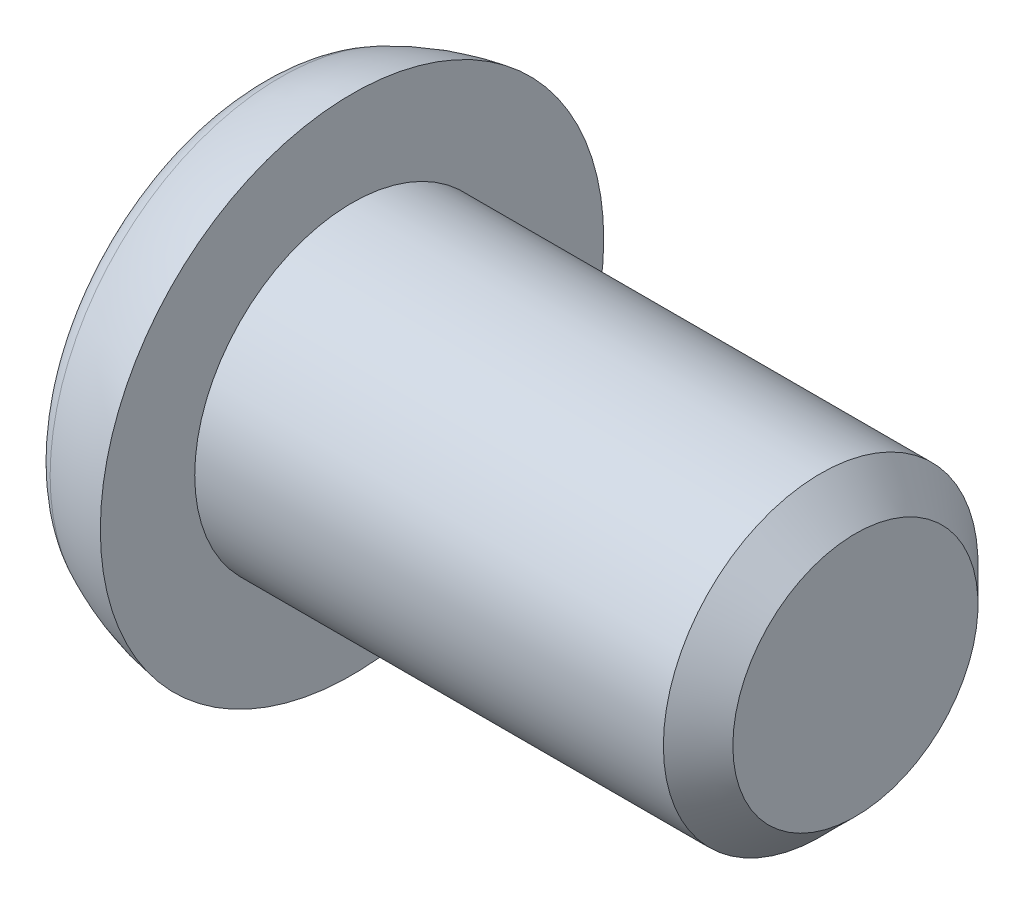
ISO-10303-21;
HEADER;
FILE_DESCRIPTION(('STEP AP214'),'2;1');
FILE_NAME('part.step','',(''),(''),'','','');
FILE_SCHEMA(('AUTOMOTIVE_DESIGN { 1 0 10303 214 1 1 1 1 }'));
ENDSEC;
DATA;
#1=APPLICATION_CONTEXT('core data for automotive mechanical design processes');
#2=APPLICATION_PROTOCOL_DEFINITION('international standard','automotive_design',2000,#1);
#3=PRODUCT_CONTEXT('',#1,'mechanical');
#4=PRODUCT('Part','Part','',(#3));
#5=PRODUCT_RELATED_PRODUCT_CATEGORY('part','',(#4));
#6=PRODUCT_DEFINITION_FORMATION('','',#4);
#7=PRODUCT_DEFINITION_CONTEXT('part definition',#1,'design');
#8=PRODUCT_DEFINITION('design','',#6,#7);
#9=PRODUCT_DEFINITION_SHAPE('','',#8);
#10=(LENGTH_UNIT() NAMED_UNIT(*) SI_UNIT(.MILLI.,.METRE.));
#11=(NAMED_UNIT(*) PLANE_ANGLE_UNIT() SI_UNIT($,.RADIAN.));
#12=(NAMED_UNIT(*) SI_UNIT($,.STERADIAN.) SOLID_ANGLE_UNIT());
#13=UNCERTAINTY_MEASURE_WITH_UNIT(LENGTH_MEASURE(1.E-05),#10,'distance_accuracy_value','');
#14=(GEOMETRIC_REPRESENTATION_CONTEXT(3) GLOBAL_UNCERTAINTY_ASSIGNED_CONTEXT((#13)) GLOBAL_UNIT_ASSIGNED_CONTEXT((#10,
#11,#12)) REPRESENTATION_CONTEXT('',''));
#15=CARTESIAN_POINT('',(0.,0.,0.));
#16=DIRECTION('',(0.,0.,1.));
#17=DIRECTION('',(1.,0.,0.));
#18=AXIS2_PLACEMENT_3D('',#15,#16,#17);
#19=CARTESIAN_POINT('',(-1.18104045222202,0.553965306488662,0.2));
#20=DIRECTION('',(0.,0.,-1.));
#21=DIRECTION('',(-1.,0.,0.));
#22=AXIS2_PLACEMENT_3D('',#19,#20,#21);
#23=CYLINDRICAL_SURFACE('',#22,1.59999999999999);
#24=CARTESIAN_POINT('',(-1.18104045222202,0.553965306488662,0.2));
#25=DIRECTION('',(0.,0.,1.));
#26=DIRECTION('',(1.,0.,0.));
#27=AXIS2_PLACEMENT_3D('',#24,#25,#26);
#28=CIRCLE('',#27,1.59999999999999);
#29=CARTESIAN_POINT('',(-0.8,-1.,0.2));
#30=VERTEX_POINT('',#29);
#31=CARTESIAN_POINT('',(0.230177573673136,-0.2,0.2));
#32=VERTEX_POINT('',#31);
#33=EDGE_CURVE('E194',#30,#32,#28,.T.);
#34=ORIENTED_EDGE('',*,*,#33,.T.);
#35=DIRECTION('',(0.,0.,-1.));
#36=VECTOR('',#35,1.);
#37=CARTESIAN_POINT('',(0.230177573673136,-0.2,0.2));
#38=LINE('',#37,#36);
#39=CARTESIAN_POINT('',(0.230177573673136,-0.2,-0.2));
#40=VERTEX_POINT('',#39);
#41=EDGE_CURVE('E137',#32,#40,#38,.T.);
#42=ORIENTED_EDGE('',*,*,#41,.T.);
#43=CARTESIAN_POINT('',(-1.18104045222202,0.553965306488662,-0.2));
#44=DIRECTION('',(0.,0.,1.));
#45=DIRECTION('',(1.,0.,0.));
#46=AXIS2_PLACEMENT_3D('',#43,#44,#45);
#47=CIRCLE('',#46,1.59999999999999);
#48=CARTESIAN_POINT('',(-0.8,-1.,-0.2));
#49=VERTEX_POINT('',#48);
#50=EDGE_CURVE('E183',#49,#40,#47,.T.);
#51=ORIENTED_EDGE('',*,*,#50,.F.);
#52=DIRECTION('',(0.,0.,-1.));
#53=VECTOR('',#52,1.);
#54=CARTESIAN_POINT('',(-0.8,-1.,0.2));
#55=LINE('',#54,#53);
#56=EDGE_CURVE('E205',#30,#49,#55,.T.);
#57=ORIENTED_EDGE('',*,*,#56,.F.);
#58=EDGE_LOOP('',(#34,#42,#51,#57));
#59=FACE_BOUND('',#58,.T.);
#60=ADVANCED_FACE('F37',(#59),#23,.F.);
#61=CARTESIAN_POINT('',(-1.18104045222202,0.553965306488662,0.2));
#62=DIRECTION('',(0.,0.,1.));
#63=DIRECTION('',(1.,0.,0.));
#64=AXIS2_PLACEMENT_3D('',#61,#62,#63);
#65=PLANE('',#64);
#66=DIRECTION('',(-1.,0.,0.));
#67=VECTOR('',#66,1.);
#68=CARTESIAN_POINT('',(-1.18104045222202,-0.2,0.2));
#69=LINE('',#68,#67);
#70=CARTESIAN_POINT('',(-0.8,-0.2,0.2));
#71=VERTEX_POINT('',#70);
#72=EDGE_CURVE('E166',#32,#71,#69,.T.);
#73=ORIENTED_EDGE('',*,*,#72,.F.);
#74=ORIENTED_EDGE('',*,*,#33,.F.);
#75=DIRECTION('',(0.,-1.,0.));
#76=VECTOR('',#75,1.);
#77=CARTESIAN_POINT('',(-0.8,1.,0.2));
#78=LINE('',#77,#76);
#79=EDGE_CURVE('E201',#71,#30,#78,.T.);
#80=ORIENTED_EDGE('',*,*,#79,.F.);
#81=EDGE_LOOP('',(#73,#74,#80));
#82=FACE_BOUND('',#81,.T.);
#83=ADVANCED_FACE('F283',(#82),#65,.F.);
#84=CARTESIAN_POINT('',(-1.18104045222202,0.553965306488662,-0.2));
#85=DIRECTION('',(0.,0.,1.));
#86=DIRECTION('',(1.,0.,0.));
#87=AXIS2_PLACEMENT_3D('',#84,#85,#86);
#88=PLANE('',#87);
#89=ORIENTED_EDGE('',*,*,#50,.T.);
#90=DIRECTION('',(-1.,0.,0.));
#91=VECTOR('',#90,1.);
#92=CARTESIAN_POINT('',(-1.18104045222202,-0.2,-0.2));
#93=LINE('',#92,#91);
#94=CARTESIAN_POINT('',(-0.8,-0.2,-0.2));
#95=VERTEX_POINT('',#94);
#96=EDGE_CURVE('E233',#40,#95,#93,.T.);
#97=ORIENTED_EDGE('',*,*,#96,.T.);
#98=DIRECTION('',(0.,-1.,0.));
#99=VECTOR('',#98,1.);
#100=CARTESIAN_POINT('',(-0.8,1.,-0.2));
#101=LINE('',#100,#99);
#102=EDGE_CURVE('E189',#95,#49,#101,.T.);
#103=ORIENTED_EDGE('',*,*,#102,.T.);
#104=EDGE_LOOP('',(#89,#97,#103));
#105=FACE_BOUND('',#104,.T.);
#106=ADVANCED_FACE('F289',(#105),#88,.T.);
#107=CARTESIAN_POINT('',(-0.8,0.,0.));
#108=DIRECTION('',(1.,0.,0.));
#109=DIRECTION('',(0.,0.,-1.));
#110=AXIS2_PLACEMENT_3D('',#107,#108,#109);
#111=PLANE('',#110);
#112=DIRECTION('',(0.,-1.,0.));
#113=VECTOR('',#112,1.);
#114=CARTESIAN_POINT('',(-0.8,0.2,-1.));
#115=LINE('',#114,#113);
#116=CARTESIAN_POINT('',(-0.8,0.2,-1.));
#117=VERTEX_POINT('',#116);
#118=CARTESIAN_POINT('',(-0.8,-0.2,-1.));
#119=VERTEX_POINT('',#118);
#120=EDGE_CURVE('E128',#117,#119,#115,.T.);
#121=ORIENTED_EDGE('',*,*,#120,.F.);
#122=DIRECTION('',(0.,0.,1.));
#123=VECTOR('',#122,1.);
#124=CARTESIAN_POINT('',(-0.8,0.2,-1.));
#125=LINE('',#124,#123);
#126=CARTESIAN_POINT('',(-0.8,0.2,-0.2));
#127=VERTEX_POINT('',#126);
#128=EDGE_CURVE('E156',#117,#127,#125,.T.);
#129=ORIENTED_EDGE('',*,*,#128,.T.);
#130=CARTESIAN_POINT('',(-0.8,1.,-0.2));
#131=VERTEX_POINT('',#130);
#132=EDGE_CURVE('E190',#131,#127,#101,.T.);
#133=ORIENTED_EDGE('',*,*,#132,.F.);
#134=DIRECTION('',(0.,0.,-1.));
#135=VECTOR('',#134,1.);
#136=CARTESIAN_POINT('',(-0.8,1.,0.2));
#137=LINE('',#136,#135);
#138=CARTESIAN_POINT('',(-0.8,1.,0.2));
#139=VERTEX_POINT('',#138);
#140=EDGE_CURVE('E208',#139,#131,#137,.T.);
#141=ORIENTED_EDGE('',*,*,#140,.F.);
#142=CARTESIAN_POINT('',(-0.8,0.2,0.2));
#143=VERTEX_POINT('',#142);
#144=EDGE_CURVE('E202',#139,#143,#78,.T.);
#145=ORIENTED_EDGE('',*,*,#144,.T.);
#146=CARTESIAN_POINT('',(-0.8,0.2,1.));
#147=VERTEX_POINT('',#146);
#148=EDGE_CURVE('E155',#143,#147,#125,.T.);
#149=ORIENTED_EDGE('',*,*,#148,.T.);
#150=DIRECTION('',(0.,-1.,0.));
#151=VECTOR('',#150,1.);
#152=CARTESIAN_POINT('',(-0.8,0.2,1.));
#153=LINE('',#152,#151);
#154=CARTESIAN_POINT('',(-0.8,-0.2,1.));
#155=VERTEX_POINT('',#154);
#156=EDGE_CURVE('E159',#147,#155,#153,.T.);
#157=ORIENTED_EDGE('',*,*,#156,.T.);
#158=DIRECTION('',(0.,0.,1.));
#159=VECTOR('',#158,1.);
#160=CARTESIAN_POINT('',(-0.8,-0.2,-1.));
#161=LINE('',#160,#159);
#162=EDGE_CURVE('E142',#71,#155,#161,.T.);
#163=ORIENTED_EDGE('',*,*,#162,.F.);
#164=ORIENTED_EDGE('',*,*,#79,.T.);
#165=ORIENTED_EDGE('',*,*,#56,.T.);
#166=ORIENTED_EDGE('',*,*,#102,.F.);
#167=EDGE_CURVE('E145',#119,#95,#161,.T.);
#168=ORIENTED_EDGE('',*,*,#167,.F.);
#169=EDGE_LOOP('',(#121,#129,#133,#141,#145,#149,#157,#163,#164,#165,#166,#168));
#170=FACE_BOUND('',#169,.T.);
#171=CARTESIAN_POINT('',(-0.8,0.,0.));
#172=DIRECTION('',(-1.,0.,0.));
#173=DIRECTION('',(0.,0.,1.));
#174=AXIS2_PLACEMENT_3D('',#171,#172,#173);
#175=CIRCLE('',#174,1.4660185501017);
#176=CARTESIAN_POINT('',(-0.8,0.,1.4660185501017));
#177=VERTEX_POINT('',#176);
#178=EDGE_CURVE('E230',#177,#177,#175,.T.);
#179=ORIENTED_EDGE('',*,*,#178,.T.);
#180=EDGE_LOOP('',(#179));
#181=FACE_BOUND('',#180,.T.);
#182=ADVANCED_FACE('F39',(#170,#181),#111,.F.);
#183=CARTESIAN_POINT('',(-0.399999999999956,0.,0.));
#184=DIRECTION('',(-1.,0.,0.));
#185=DIRECTION('',(0.,0.,1.));
#186=AXIS2_PLACEMENT_3D('',#183,#184,#185);
#187=TOROIDAL_SURFACE('',#186,1.46601855010163,0.400000000000044);
#188=ORIENTED_EDGE('',*,*,#178,.F.);
#189=EDGE_LOOP('',(#188));
#190=FACE_BOUND('',#189,.T.);
#191=CARTESIAN_POINT('',(-0.57150995157356,0.,0.));
#192=DIRECTION('',(-1.,0.,0.));
#193=DIRECTION('',(0.,0.,1.));
#194=AXIS2_PLACEMENT_3D('',#191,#192,#193);
#195=CIRCLE('',#194,1.8273830980463);
#196=CARTESIAN_POINT('',(-0.57150995157356,0.,1.8273830980463));
#197=VERTEX_POINT('',#196);
#198=EDGE_CURVE('E227',#197,#197,#195,.T.);
#199=ORIENTED_EDGE('',*,*,#198,.T.);
#200=EDGE_LOOP('',(#199));
#201=FACE_BOUND('',#200,.T.);
#202=ADVANCED_FACE('F358',(#190,#201),#187,.T.);
#203=CARTESIAN_POINT('',(0.286039856663423,0.,0.));
#204=DIRECTION('',(-1.,0.,0.));
#205=DIRECTION('',(0.,0.,1.));
#206=AXIS2_PLACEMENT_3D('',#203,#204,#205);
#207=DEGENERATE_TOROIDAL_SURFACE('',#206,0.0205603822311625,1.99999999999822,.T.);
#208=ORIENTED_EDGE('',*,*,#198,.F.);
#209=EDGE_LOOP('',(#208));
#210=FACE_BOUND('',#209,.T.);
#211=CARTESIAN_POINT('',(0.,0.,0.));
#212=DIRECTION('',(-1.,0.,0.));
#213=DIRECTION('',(0.,0.,1.));
#214=AXIS2_PLACEMENT_3D('',#211,#212,#213);
#215=CIRCLE('',#214,2.);
#216=CARTESIAN_POINT('',(0.,0.,2.));
#217=VERTEX_POINT('',#216);
#218=EDGE_CURVE('E224',#217,#217,#215,.T.);
#219=ORIENTED_EDGE('',*,*,#218,.T.);
#220=EDGE_LOOP('',(#219));
#221=FACE_BOUND('',#220,.T.);
#222=ADVANCED_FACE('F362',(#210,#221),#207,.T.);
#223=CARTESIAN_POINT('',(0.,2.,0.));
#224=DIRECTION('',(-1.,0.,0.));
#225=DIRECTION('',(0.,0.,1.));
#226=AXIS2_PLACEMENT_3D('',#223,#224,#225);
#227=PLANE('',#226);
#228=ORIENTED_EDGE('',*,*,#218,.F.);
#229=EDGE_LOOP('',(#228));
#230=FACE_BOUND('',#229,.T.);
#231=CARTESIAN_POINT('',(0.,0.,0.));
#232=DIRECTION('',(-1.,0.,0.));
#233=DIRECTION('',(0.,0.,1.));
#234=AXIS2_PLACEMENT_3D('',#231,#232,#233);
#235=CIRCLE('',#234,1.25);
#236=CARTESIAN_POINT('',(0.,0.,1.25));
#237=VERTEX_POINT('',#236);
#238=EDGE_CURVE('E221',#237,#237,#235,.T.);
#239=ORIENTED_EDGE('',*,*,#238,.T.);
#240=EDGE_LOOP('',(#239));
#241=FACE_BOUND('',#240,.T.);
#242=ADVANCED_FACE('F367',(#230,#241),#227,.F.);
#243=CARTESIAN_POINT('',(4.,0.,0.));
#244=DIRECTION('',(-1.,0.,0.));
#245=DIRECTION('',(0.,0.,1.));
#246=AXIS2_PLACEMENT_3D('',#243,#244,#245);
#247=CYLINDRICAL_SURFACE('',#246,1.25);
#248=ORIENTED_EDGE('',*,*,#238,.F.);
#249=EDGE_LOOP('',(#248));
#250=FACE_BOUND('',#249,.T.);
#251=CARTESIAN_POINT('',(3.724,0.,0.));
#252=DIRECTION('',(-1.,0.,0.));
#253=DIRECTION('',(0.,0.,1.));
#254=AXIS2_PLACEMENT_3D('',#251,#252,#253);
#255=CIRCLE('',#254,1.25);
#256=CARTESIAN_POINT('',(3.724,0.,1.25));
#257=VERTEX_POINT('',#256);
#258=EDGE_CURVE('E218',#257,#257,#255,.T.);
#259=ORIENTED_EDGE('',*,*,#258,.T.);
#260=EDGE_LOOP('',(#259));
#261=FACE_BOUND('',#260,.T.);
#262=ADVANCED_FACE('F375',(#250,#261),#247,.T.);
#263=CARTESIAN_POINT('',(4.,0.,0.));
#264=DIRECTION('',(-1.,0.,0.));
#265=DIRECTION('',(0.,0.,1.));
#266=AXIS2_PLACEMENT_3D('',#263,#264,#265);
#267=CONICAL_SURFACE('',#266,0.974,0.785398163397448);
#268=ORIENTED_EDGE('',*,*,#258,.F.);
#269=EDGE_LOOP('',(#268));
#270=FACE_BOUND('',#269,.T.);
#271=CARTESIAN_POINT('',(4.,0.,0.));
#272=DIRECTION('',(-1.,0.,0.));
#273=DIRECTION('',(0.,0.,1.));
#274=AXIS2_PLACEMENT_3D('',#271,#272,#273);
#275=CIRCLE('',#274,0.974);
#276=CARTESIAN_POINT('',(4.,0.,0.974));
#277=VERTEX_POINT('',#276);
#278=EDGE_CURVE('E215',#277,#277,#275,.T.);
#279=ORIENTED_EDGE('',*,*,#278,.T.);
#280=EDGE_LOOP('',(#279));
#281=FACE_BOUND('',#280,.T.);
#282=ADVANCED_FACE('F379',(#270,#281),#267,.T.);
#283=CARTESIAN_POINT('',(4.,0.974,0.));
#284=DIRECTION('',(-1.,0.,0.));
#285=DIRECTION('',(0.,0.,1.));
#286=AXIS2_PLACEMENT_3D('',#283,#284,#285);
#287=PLANE('',#286);
#288=ORIENTED_EDGE('',*,*,#278,.F.);
#289=EDGE_LOOP('',(#288));
#290=FACE_BOUND('',#289,.T.);
#291=ADVANCED_FACE('F339',(#290),#287,.F.);
#292=CARTESIAN_POINT('',(-1.18104045222202,-0.553965306488661,0.2));
#293=DIRECTION('',(0.,0.,-1.));
#294=DIRECTION('',(-1.,0.,0.));
#295=AXIS2_PLACEMENT_3D('',#292,#293,#294);
#296=CYLINDRICAL_SURFACE('',#295,1.59999999999999);
#297=DIRECTION('',(0.,0.,-1.));
#298=VECTOR('',#297,1.);
#299=CARTESIAN_POINT('',(0.230177573673136,0.2,0.2));
#300=LINE('',#299,#298);
#301=CARTESIAN_POINT('',(0.230177573673136,0.2,0.2));
#302=VERTEX_POINT('',#301);
#303=CARTESIAN_POINT('',(0.230177573673136,0.2,-0.2));
#304=VERTEX_POINT('',#303);
#305=EDGE_CURVE('E168',#302,#304,#300,.T.);
#306=ORIENTED_EDGE('',*,*,#305,.F.);
#307=CARTESIAN_POINT('',(-1.18104045222202,-0.553965306488661,0.2));
#308=DIRECTION('',(0.,0.,1.));
#309=DIRECTION('',(1.,0.,0.));
#310=AXIS2_PLACEMENT_3D('',#307,#308,#309);
#311=CIRCLE('',#310,1.59999999999999);
#312=EDGE_CURVE('E197',#302,#139,#311,.T.);
#313=ORIENTED_EDGE('',*,*,#312,.T.);
#314=ORIENTED_EDGE('',*,*,#140,.T.);
#315=CARTESIAN_POINT('',(-1.18104045222202,-0.553965306488661,-0.2));
#316=DIRECTION('',(0.,0.,1.));
#317=DIRECTION('',(1.,0.,0.));
#318=AXIS2_PLACEMENT_3D('',#315,#316,#317);
#319=CIRCLE('',#318,1.59999999999999);
#320=EDGE_CURVE('E185',#304,#131,#319,.T.);
#321=ORIENTED_EDGE('',*,*,#320,.F.);
#322=EDGE_LOOP('',(#306,#313,#314,#321));
#323=FACE_BOUND('',#322,.T.);
#324=ADVANCED_FACE('F251',(#323),#296,.F.);
#325=ORIENTED_EDGE('',*,*,#312,.F.);
#326=DIRECTION('',(-1.,0.,0.));
#327=VECTOR('',#326,1.);
#328=CARTESIAN_POINT('',(-1.18104045222202,0.2,0.2));
#329=LINE('',#328,#327);
#330=EDGE_CURVE('E171',#302,#143,#329,.T.);
#331=ORIENTED_EDGE('',*,*,#330,.T.);
#332=ORIENTED_EDGE('',*,*,#144,.F.);
#333=EDGE_LOOP('',(#325,#331,#332));
#334=FACE_BOUND('',#333,.T.);
#335=ADVANCED_FACE('F255',(#334),#65,.F.);
#336=DIRECTION('',(-1.,0.,0.));
#337=VECTOR('',#336,1.);
#338=CARTESIAN_POINT('',(-1.18104045222202,0.2,-0.2));
#339=LINE('',#338,#337);
#340=EDGE_CURVE('E45',#304,#127,#339,.T.);
#341=ORIENTED_EDGE('',*,*,#340,.F.);
#342=ORIENTED_EDGE('',*,*,#320,.T.);
#343=ORIENTED_EDGE('',*,*,#132,.T.);
#344=EDGE_LOOP('',(#341,#342,#343));
#345=FACE_BOUND('',#344,.T.);
#346=ADVANCED_FACE('F248',(#345),#88,.T.);
#347=CARTESIAN_POINT('',(-1.18104045222202,-0.2,-0.553965306488662));
#348=DIRECTION('',(0.,1.,0.));
#349=DIRECTION('',(0.,0.,1.));
#350=AXIS2_PLACEMENT_3D('',#347,#348,#349);
#351=PLANE('',#350);
#352=CARTESIAN_POINT('',(-1.18104045222202,-0.2,0.553965306488661));
#353=DIRECTION('',(0.,1.,0.));
#354=DIRECTION('',(0.,0.,1.));
#355=AXIS2_PLACEMENT_3D('',#352,#353,#354);
#356=CIRCLE('',#355,1.59999999999999);
#357=EDGE_CURVE('E143',#40,#119,#356,.T.);
#358=ORIENTED_EDGE('',*,*,#357,.T.);
#359=ORIENTED_EDGE('',*,*,#167,.T.);
#360=ORIENTED_EDGE('',*,*,#96,.F.);
#361=EDGE_LOOP('',(#358,#359,#360));
#362=FACE_BOUND('',#361,.T.);
#363=ADVANCED_FACE('F292',(#362),#351,.T.);
#364=CARTESIAN_POINT('',(-1.18104045222202,0.2,-0.553965306488662));
#365=DIRECTION('',(0.,1.,0.));
#366=DIRECTION('',(0.,0.,1.));
#367=AXIS2_PLACEMENT_3D('',#364,#365,#366);
#368=PLANE('',#367);
#369=ORIENTED_EDGE('',*,*,#340,.T.);
#370=ORIENTED_EDGE('',*,*,#128,.F.);
#371=CARTESIAN_POINT('',(-1.18104045222202,0.2,0.553965306488661));
#372=DIRECTION('',(0.,1.,0.));
#373=DIRECTION('',(0.,0.,1.));
#374=AXIS2_PLACEMENT_3D('',#371,#372,#373);
#375=CIRCLE('',#374,1.59999999999999);
#376=EDGE_CURVE('E59',#304,#117,#375,.T.);
#377=ORIENTED_EDGE('',*,*,#376,.F.);
#378=EDGE_LOOP('',(#369,#370,#377));
#379=FACE_BOUND('',#378,.T.);
#380=ADVANCED_FACE('F239',(#379),#368,.F.);
#381=CARTESIAN_POINT('',(-1.18104045222202,0.2,0.553965306488661));
#382=DIRECTION('',(0.,-1.,0.));
#383=DIRECTION('',(0.,0.,-1.));
#384=AXIS2_PLACEMENT_3D('',#381,#382,#383);
#385=CYLINDRICAL_SURFACE('',#384,1.59999999999999);
#386=ORIENTED_EDGE('',*,*,#376,.T.);
#387=ORIENTED_EDGE('',*,*,#120,.T.);
#388=ORIENTED_EDGE('',*,*,#357,.F.);
#389=DIRECTION('',(0.,-1.,0.));
#390=VECTOR('',#389,1.);
#391=CARTESIAN_POINT('',(0.230177573673136,0.2,-0.2));
#392=LINE('',#391,#390);
#393=EDGE_CURVE('E236',#304,#40,#392,.T.);
#394=ORIENTED_EDGE('',*,*,#393,.F.);
#395=EDGE_LOOP('',(#386,#387,#388,#394));
#396=FACE_BOUND('',#395,.T.);
#397=ADVANCED_FACE('F294',(#396),#385,.F.);
#398=CARTESIAN_POINT('',(0.32,0.,-0.2));
#399=VERTEX_POINT('',#398);
#400=EDGE_CURVE('E186',#399,#304,#319,.T.);
#401=ORIENTED_EDGE('',*,*,#400,.T.);
#402=ORIENTED_EDGE('',*,*,#393,.T.);
#403=EDGE_CURVE('E182',#40,#399,#47,.T.);
#404=ORIENTED_EDGE('',*,*,#403,.T.);
#405=EDGE_LOOP('',(#401,#402,#404));
#406=FACE_BOUND('',#405,.T.);
#407=ADVANCED_FACE('F297',(#406),#88,.T.);
#408=DIRECTION('',(0.,0.,-1.));
#409=VECTOR('',#408,1.);
#410=CARTESIAN_POINT('',(0.32,0.,0.2));
#411=LINE('',#410,#409);
#412=CARTESIAN_POINT('',(0.32,0.,0.));
#413=VERTEX_POINT('',#412);
#414=EDGE_CURVE('E211',#413,#399,#411,.T.);
#415=ORIENTED_EDGE('',*,*,#414,.F.);
#416=CARTESIAN_POINT('',(-1.18104045222202,-0.553965306488661,0.553965306488661));
#417=DIRECTION('',(0.,-0.707106781186547,-0.707106781186547));
#418=DIRECTION('',(0.,0.707106781186547,-0.707106781186547));
#419=AXIS2_PLACEMENT_3D('',#416,#417,#418);
#420=ELLIPSE('',#419,2.26274169979693,1.59999999999999);
#421=EDGE_CURVE('E174',#413,#304,#420,.F.);
#422=ORIENTED_EDGE('',*,*,#421,.T.);
#423=ORIENTED_EDGE('',*,*,#400,.F.);
#424=EDGE_LOOP('',(#415,#422,#423));
#425=FACE_BOUND('',#424,.T.);
#426=ADVANCED_FACE('F301',(#425),#296,.F.);
#427=ORIENTED_EDGE('',*,*,#403,.F.);
#428=CARTESIAN_POINT('',(-1.18104045222202,0.553965306488662,0.553965306488661));
#429=DIRECTION('',(0.,0.707106781186547,-0.707106781186547));
#430=DIRECTION('',(0.,-0.707106781186547,-0.707106781186547));
#431=AXIS2_PLACEMENT_3D('',#428,#429,#430);
#432=ELLIPSE('',#431,2.26274169979693,1.59999999999999);
#433=EDGE_CURVE('E141',#40,#413,#432,.F.);
#434=ORIENTED_EDGE('',*,*,#433,.T.);
#435=ORIENTED_EDGE('',*,*,#414,.T.);
#436=EDGE_LOOP('',(#427,#434,#435));
#437=FACE_BOUND('',#436,.T.);
#438=ADVANCED_FACE('F317',(#437),#23,.F.);
#439=ORIENTED_EDGE('',*,*,#72,.T.);
#440=ORIENTED_EDGE('',*,*,#162,.T.);
#441=CARTESIAN_POINT('',(-1.18104045222202,-0.2,-0.553965306488662));
#442=DIRECTION('',(0.,1.,0.));
#443=DIRECTION('',(0.,0.,1.));
#444=AXIS2_PLACEMENT_3D('',#441,#442,#443);
#445=CIRCLE('',#444,1.59999999999999);
#446=EDGE_CURVE('E52',#155,#32,#445,.T.);
#447=ORIENTED_EDGE('',*,*,#446,.T.);
#448=EDGE_LOOP('',(#439,#440,#447));
#449=FACE_BOUND('',#448,.T.);
#450=ADVANCED_FACE('F327',(#449),#351,.T.);
#451=CARTESIAN_POINT('',(-1.18104045222202,0.2,-0.553965306488662));
#452=DIRECTION('',(0.,1.,0.));
#453=DIRECTION('',(0.,0.,1.));
#454=AXIS2_PLACEMENT_3D('',#451,#452,#453);
#455=CIRCLE('',#454,1.59999999999999);
#456=EDGE_CURVE('E149',#147,#302,#455,.T.);
#457=ORIENTED_EDGE('',*,*,#456,.F.);
#458=ORIENTED_EDGE('',*,*,#148,.F.);
#459=ORIENTED_EDGE('',*,*,#330,.F.);
#460=EDGE_LOOP('',(#457,#458,#459));
#461=FACE_BOUND('',#460,.T.);
#462=ADVANCED_FACE('F260',(#461),#368,.F.);
#463=CARTESIAN_POINT('',(-1.18104045222202,0.2,-0.553965306488662));
#464=DIRECTION('',(0.,-1.,0.));
#465=DIRECTION('',(0.,0.,-1.));
#466=AXIS2_PLACEMENT_3D('',#463,#464,#465);
#467=CYLINDRICAL_SURFACE('',#466,1.59999999999999);
#468=DIRECTION('',(0.,-1.,0.));
#469=VECTOR('',#468,1.);
#470=CARTESIAN_POINT('',(0.230177573673136,0.2,0.2));
#471=LINE('',#470,#469);
#472=EDGE_CURVE('E11',#302,#32,#471,.T.);
#473=ORIENTED_EDGE('',*,*,#472,.T.);
#474=ORIENTED_EDGE('',*,*,#446,.F.);
#475=ORIENTED_EDGE('',*,*,#156,.F.);
#476=ORIENTED_EDGE('',*,*,#456,.T.);
#477=EDGE_LOOP('',(#473,#474,#475,#476));
#478=FACE_BOUND('',#477,.T.);
#479=ADVANCED_FACE('F277',(#478),#467,.F.);
#480=ORIENTED_EDGE('',*,*,#472,.F.);
#481=CARTESIAN_POINT('',(0.32,0.,0.2));
#482=VERTEX_POINT('',#481);
#483=EDGE_CURVE('E198',#482,#302,#311,.T.);
#484=ORIENTED_EDGE('',*,*,#483,.F.);
#485=EDGE_CURVE('E193',#32,#482,#28,.T.);
#486=ORIENTED_EDGE('',*,*,#485,.F.);
#487=EDGE_LOOP('',(#480,#484,#486));
#488=FACE_BOUND('',#487,.T.);
#489=ADVANCED_FACE('F275',(#488),#65,.F.);
#490=ORIENTED_EDGE('',*,*,#483,.T.);
#491=CARTESIAN_POINT('',(-1.18104045222202,-0.553965306488661,-0.553965306488662));
#492=DIRECTION('',(0.,0.707106781186547,-0.707106781186547));
#493=DIRECTION('',(0.,-0.707106781186547,-0.707106781186547));
#494=AXIS2_PLACEMENT_3D('',#491,#492,#493);
#495=ELLIPSE('',#494,2.26274169979693,1.59999999999999);
#496=EDGE_CURVE('E178',#302,#413,#495,.T.);
#497=ORIENTED_EDGE('',*,*,#496,.T.);
#498=EDGE_CURVE('E212',#482,#413,#411,.T.);
#499=ORIENTED_EDGE('',*,*,#498,.F.);
#500=EDGE_LOOP('',(#490,#497,#499));
#501=FACE_BOUND('',#500,.T.);
#502=ADVANCED_FACE('F272',(#501),#296,.F.);
#503=ORIENTED_EDGE('',*,*,#498,.T.);
#504=CARTESIAN_POINT('',(-1.18104045222202,0.553965306488662,-0.553965306488662));
#505=DIRECTION('',(0.,-0.707106781186547,-0.707106781186547));
#506=DIRECTION('',(0.,0.707106781186547,-0.707106781186547));
#507=AXIS2_PLACEMENT_3D('',#504,#505,#506);
#508=ELLIPSE('',#507,2.26274169979693,1.59999999999999);
#509=EDGE_CURVE('E122',#413,#32,#508,.T.);
#510=ORIENTED_EDGE('',*,*,#509,.T.);
#511=ORIENTED_EDGE('',*,*,#485,.T.);
#512=EDGE_LOOP('',(#503,#510,#511));
#513=FACE_BOUND('',#512,.T.);
#514=ADVANCED_FACE('F311',(#513),#23,.F.);
#515=ORIENTED_EDGE('',*,*,#305,.T.);
#516=CARTESIAN_POINT('',(0.32,0.2,0.));
#517=VERTEX_POINT('',#516);
#518=EDGE_CURVE('E152',#517,#304,#375,.T.);
#519=ORIENTED_EDGE('',*,*,#518,.F.);
#520=EDGE_CURVE('E148',#302,#517,#455,.T.);
#521=ORIENTED_EDGE('',*,*,#520,.F.);
#522=EDGE_LOOP('',(#515,#519,#521));
#523=FACE_BOUND('',#522,.T.);
#524=ADVANCED_FACE('F269',(#523),#368,.F.);
#525=DIRECTION('',(0.,-1.,0.));
#526=VECTOR('',#525,1.);
#527=CARTESIAN_POINT('',(0.32,0.2,0.));
#528=LINE('',#527,#526);
#529=EDGE_CURVE('E127',#517,#413,#528,.T.);
#530=ORIENTED_EDGE('',*,*,#529,.F.);
#531=ORIENTED_EDGE('',*,*,#518,.T.);
#532=ORIENTED_EDGE('',*,*,#421,.F.);
#533=EDGE_LOOP('',(#530,#531,#532));
#534=FACE_BOUND('',#533,.T.);
#535=ADVANCED_FACE('F303',(#534),#385,.F.);
#536=ORIENTED_EDGE('',*,*,#520,.T.);
#537=ORIENTED_EDGE('',*,*,#529,.T.);
#538=ORIENTED_EDGE('',*,*,#496,.F.);
#539=EDGE_LOOP('',(#536,#537,#538));
#540=FACE_BOUND('',#539,.T.);
#541=ADVANCED_FACE('F263',(#540),#467,.F.);
#542=CARTESIAN_POINT('',(0.32,-0.2,0.));
#543=VERTEX_POINT('',#542);
#544=EDGE_CURVE('E116',#413,#543,#528,.T.);
#545=ORIENTED_EDGE('',*,*,#544,.T.);
#546=EDGE_CURVE('E119',#32,#543,#445,.T.);
#547=ORIENTED_EDGE('',*,*,#546,.F.);
#548=ORIENTED_EDGE('',*,*,#509,.F.);
#549=EDGE_LOOP('',(#545,#547,#548));
#550=FACE_BOUND('',#549,.T.);
#551=ADVANCED_FACE('F118',(#550),#467,.F.);
#552=EDGE_CURVE('E134',#543,#40,#356,.T.);
#553=ORIENTED_EDGE('',*,*,#552,.F.);
#554=ORIENTED_EDGE('',*,*,#544,.F.);
#555=ORIENTED_EDGE('',*,*,#433,.F.);
#556=EDGE_LOOP('',(#553,#554,#555));
#557=FACE_BOUND('',#556,.T.);
#558=ADVANCED_FACE('F139',(#557),#385,.F.);
#559=ORIENTED_EDGE('',*,*,#546,.T.);
#560=ORIENTED_EDGE('',*,*,#552,.T.);
#561=ORIENTED_EDGE('',*,*,#41,.F.);
#562=EDGE_LOOP('',(#559,#560,#561));
#563=FACE_BOUND('',#562,.T.);
#564=ADVANCED_FACE('F133',(#563),#351,.T.);
#565=CLOSED_SHELL('',(#60,#83,#106,#182,#202,#222,#242,#262,#282,#291,#324,#335,#346,#363,#380,
#397,#407,#426,#438,#450,#462,#479,#489,#502,#514,#524,#535,#541,#551,#558,#564));
#566=MANIFOLD_SOLID_BREP('B2',#565);
#567=ADVANCED_BREP_SHAPE_REPRESENTATION('',(#18,#566),#14);
#568=SHAPE_DEFINITION_REPRESENTATION(#9,#567);
ENDSEC;
END-ISO-10303-21;
